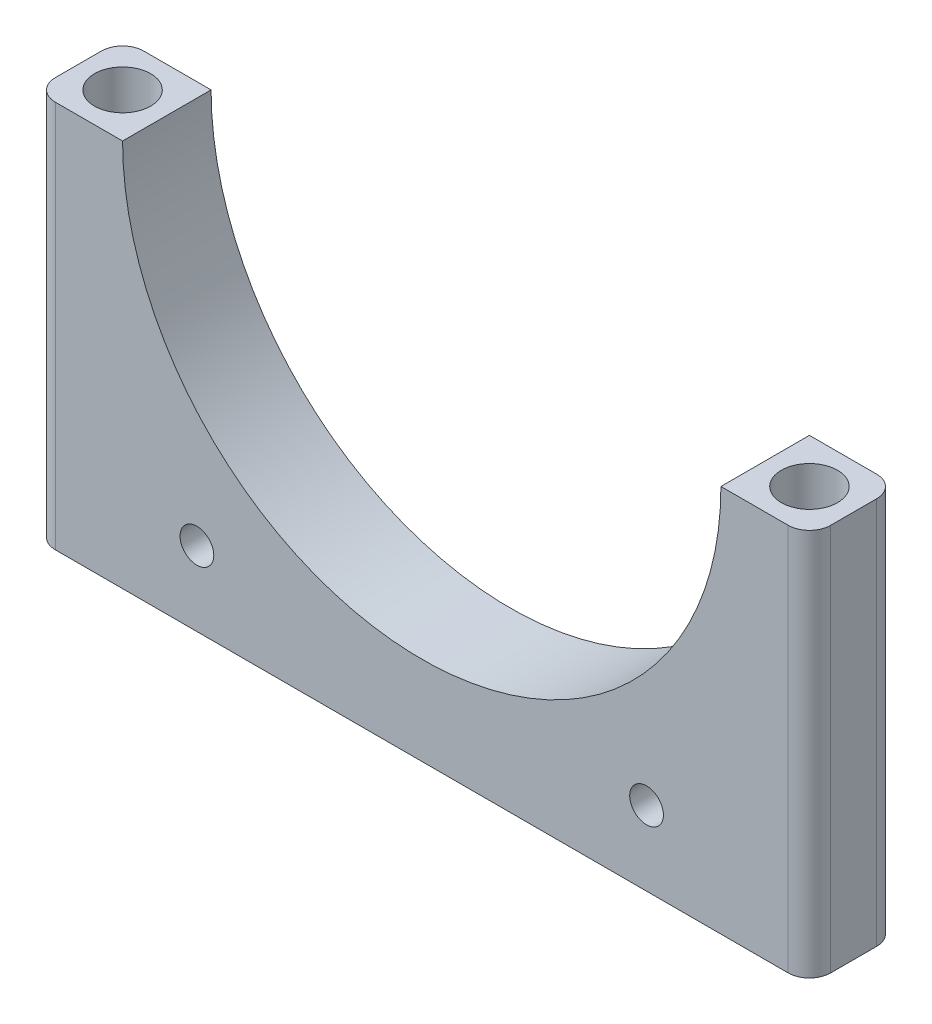
ISO-10303-21;
HEADER;
FILE_DESCRIPTION(('STEP AP214'),'2;1');
FILE_NAME('part.step','',(''),(''),'','','');
FILE_SCHEMA(('AUTOMOTIVE_DESIGN { 1 0 10303 214 1 1 1 1 }'));
ENDSEC;
DATA;
#1=APPLICATION_CONTEXT('core data for automotive mechanical design processes');
#2=APPLICATION_PROTOCOL_DEFINITION('international standard','automotive_design',2000,#1);
#3=PRODUCT_CONTEXT('',#1,'mechanical');
#4=PRODUCT('Part','Part','',(#3));
#5=PRODUCT_RELATED_PRODUCT_CATEGORY('part','',(#4));
#6=PRODUCT_DEFINITION_FORMATION('','',#4);
#7=PRODUCT_DEFINITION_CONTEXT('part definition',#1,'design');
#8=PRODUCT_DEFINITION('design','',#6,#7);
#9=PRODUCT_DEFINITION_SHAPE('','',#8);
#10=(LENGTH_UNIT() NAMED_UNIT(*) SI_UNIT(.MILLI.,.METRE.));
#11=(NAMED_UNIT(*) PLANE_ANGLE_UNIT() SI_UNIT($,.RADIAN.));
#12=(NAMED_UNIT(*) SI_UNIT($,.STERADIAN.) SOLID_ANGLE_UNIT());
#13=UNCERTAINTY_MEASURE_WITH_UNIT(LENGTH_MEASURE(1.E-05),#10,'distance_accuracy_value','');
#14=(GEOMETRIC_REPRESENTATION_CONTEXT(3) GLOBAL_UNCERTAINTY_ASSIGNED_CONTEXT((#13)) GLOBAL_UNIT_ASSIGNED_CONTEXT((#10,
#11,#12)) REPRESENTATION_CONTEXT('',''));
#15=CARTESIAN_POINT('',(0.,0.,0.));
#16=DIRECTION('',(0.,0.,1.));
#17=DIRECTION('',(1.,0.,0.));
#18=AXIS2_PLACEMENT_3D('',#15,#16,#17);
#19=CARTESIAN_POINT('',(0.,0.,25.));
#20=DIRECTION('',(0.,0.,1.));
#21=DIRECTION('',(1.,0.,0.));
#22=AXIS2_PLACEMENT_3D('',#19,#20,#21);
#23=PLANE('',#22);
#24=CARTESIAN_POINT('',(63.5,-3.99999999999999,25.));
#25=DIRECTION('',(0.,0.,1.));
#26=DIRECTION('',(1.,0.,0.));
#27=AXIS2_PLACEMENT_3D('',#24,#25,#26);
#28=CIRCLE('',#27,4.7625);
#29=CARTESIAN_POINT('',(68.2625,-3.99999999999999,25.));
#30=VERTEX_POINT('',#29);
#31=EDGE_CURVE('E235',#30,#30,#28,.F.);
#32=ORIENTED_EDGE('',*,*,#31,.T.);
#33=EDGE_LOOP('',(#32));
#34=FACE_BOUND('',#33,.T.);
#35=DIRECTION('',(-1.,0.,0.));
#36=VECTOR('',#35,1.);
#37=CARTESIAN_POINT('',(0.,-25.,25.));
#38=LINE('',#37,#36);
#39=CARTESIAN_POINT('',(103.5,-25.,25.));
#40=VERTEX_POINT('',#39);
#41=CARTESIAN_POINT('',(-103.5,-25.,25.));
#42=VERTEX_POINT('',#41);
#43=EDGE_CURVE('E140',#40,#42,#38,.T.);
#44=ORIENTED_EDGE('',*,*,#43,.F.);
#45=DIRECTION('',(0.,-1.,0.));
#46=VECTOR('',#45,1.);
#47=CARTESIAN_POINT('',(103.5,0.,25.));
#48=LINE('',#47,#46);
#49=CARTESIAN_POINT('',(103.5,84.5,25.));
#50=VERTEX_POINT('',#49);
#51=EDGE_CURVE('E139',#40,#50,#48,.F.);
#52=ORIENTED_EDGE('',*,*,#51,.T.);
#53=DIRECTION('',(1.,0.,0.));
#54=VECTOR('',#53,1.);
#55=CARTESIAN_POINT('',(0.,84.5,25.));
#56=LINE('',#55,#54);
#57=CARTESIAN_POINT('',(84.5,84.5,25.));
#58=VERTEX_POINT('',#57);
#59=EDGE_CURVE('E121',#58,#50,#56,.T.);
#60=ORIENTED_EDGE('',*,*,#59,.F.);
#61=CARTESIAN_POINT('',(0.,84.5,25.));
#62=DIRECTION('',(0.,0.,1.));
#63=DIRECTION('',(1.,0.,0.));
#64=AXIS2_PLACEMENT_3D('',#61,#62,#63);
#65=CIRCLE('',#64,84.5);
#66=CARTESIAN_POINT('',(-84.5,84.5,25.));
#67=VERTEX_POINT('',#66);
#68=EDGE_CURVE('E137',#67,#58,#65,.T.);
#69=ORIENTED_EDGE('',*,*,#68,.F.);
#70=CARTESIAN_POINT('',(-103.5,84.5,25.));
#71=VERTEX_POINT('',#70);
#72=EDGE_CURVE('E142',#71,#67,#56,.T.);
#73=ORIENTED_EDGE('',*,*,#72,.F.);
#74=DIRECTION('',(0.,-1.,0.));
#75=VECTOR('',#74,1.);
#76=CARTESIAN_POINT('',(-103.5,-25.,25.));
#77=LINE('',#76,#75);
#78=EDGE_CURVE('E189',#71,#42,#77,.T.);
#79=ORIENTED_EDGE('',*,*,#78,.T.);
#80=EDGE_LOOP('',(#44,#52,#60,#69,#73,#79));
#81=FACE_BOUND('',#80,.T.);
#82=CARTESIAN_POINT('',(-63.5,-4.00000000000001,25.));
#83=DIRECTION('',(0.,0.,1.));
#84=DIRECTION('',(1.,0.,0.));
#85=AXIS2_PLACEMENT_3D('',#82,#83,#84);
#86=CIRCLE('',#85,4.7625);
#87=CARTESIAN_POINT('',(-58.7375,-4.00000000000001,25.));
#88=VERTEX_POINT('',#87);
#89=EDGE_CURVE('E173',#88,#88,#86,.T.);
#90=ORIENTED_EDGE('',*,*,#89,.F.);
#91=EDGE_LOOP('',(#90));
#92=FACE_BOUND('',#91,.T.);
#93=ADVANCED_FACE('F41',(#34,#81,#92),#23,.T.);
#94=CARTESIAN_POINT('',(0.,0.,0.));
#95=DIRECTION('',(0.,0.,1.));
#96=DIRECTION('',(1.,0.,0.));
#97=AXIS2_PLACEMENT_3D('',#94,#95,#96);
#98=PLANE('',#97);
#99=DIRECTION('',(1.,0.,0.));
#100=VECTOR('',#99,1.);
#101=CARTESIAN_POINT('',(0.,84.5,0.));
#102=LINE('',#101,#100);
#103=CARTESIAN_POINT('',(84.5,84.5,0.));
#104=VERTEX_POINT('',#103);
#105=CARTESIAN_POINT('',(103.5,84.5,0.));
#106=VERTEX_POINT('',#105);
#107=EDGE_CURVE('E124',#104,#106,#102,.T.);
#108=ORIENTED_EDGE('',*,*,#107,.T.);
#109=DIRECTION('',(0.,-1.,0.));
#110=VECTOR('',#109,1.);
#111=CARTESIAN_POINT('',(103.5,-25.,0.));
#112=LINE('',#111,#110);
#113=CARTESIAN_POINT('',(103.5,-25.,0.));
#114=VERTEX_POINT('',#113);
#115=EDGE_CURVE('E199',#106,#114,#112,.T.);
#116=ORIENTED_EDGE('',*,*,#115,.T.);
#117=DIRECTION('',(-1.,0.,0.));
#118=VECTOR('',#117,1.);
#119=CARTESIAN_POINT('',(0.,-25.,0.));
#120=LINE('',#119,#118);
#121=CARTESIAN_POINT('',(-103.5,-25.,0.));
#122=VERTEX_POINT('',#121);
#123=EDGE_CURVE('E150',#114,#122,#120,.T.);
#124=ORIENTED_EDGE('',*,*,#123,.T.);
#125=DIRECTION('',(0.,-1.,0.));
#126=VECTOR('',#125,1.);
#127=CARTESIAN_POINT('',(-103.5,0.,0.));
#128=LINE('',#127,#126);
#129=CARTESIAN_POINT('',(-103.5,84.5,0.));
#130=VERTEX_POINT('',#129);
#131=EDGE_CURVE('E197',#122,#130,#128,.F.);
#132=ORIENTED_EDGE('',*,*,#131,.T.);
#133=CARTESIAN_POINT('',(-84.5,84.5,0.));
#134=VERTEX_POINT('',#133);
#135=EDGE_CURVE('E156',#130,#134,#102,.T.);
#136=ORIENTED_EDGE('',*,*,#135,.T.);
#137=CARTESIAN_POINT('',(0.,84.5,0.));
#138=DIRECTION('',(0.,0.,1.));
#139=DIRECTION('',(1.,0.,0.));
#140=AXIS2_PLACEMENT_3D('',#137,#138,#139);
#141=CIRCLE('',#140,84.5);
#142=EDGE_CURVE('E155',#134,#104,#141,.T.);
#143=ORIENTED_EDGE('',*,*,#142,.T.);
#144=EDGE_LOOP('',(#108,#116,#124,#132,#136,#143));
#145=FACE_BOUND('',#144,.T.);
#146=CARTESIAN_POINT('',(63.5,-3.99999999999999,0.));
#147=DIRECTION('',(0.,0.,1.));
#148=DIRECTION('',(1.,0.,0.));
#149=AXIS2_PLACEMENT_3D('',#146,#147,#148);
#150=CIRCLE('',#149,4.7625);
#151=CARTESIAN_POINT('',(68.2625,-3.99999999999999,0.));
#152=VERTEX_POINT('',#151);
#153=EDGE_CURVE('E169',#152,#152,#150,.F.);
#154=ORIENTED_EDGE('',*,*,#153,.F.);
#155=EDGE_LOOP('',(#154));
#156=FACE_BOUND('',#155,.T.);
#157=CARTESIAN_POINT('',(-63.5,-4.00000000000001,0.));
#158=DIRECTION('',(0.,0.,1.));
#159=DIRECTION('',(1.,0.,0.));
#160=AXIS2_PLACEMENT_3D('',#157,#158,#159);
#161=CIRCLE('',#160,4.7625);
#162=CARTESIAN_POINT('',(-58.7375,-4.00000000000001,0.));
#163=VERTEX_POINT('',#162);
#164=EDGE_CURVE('E172',#163,#163,#161,.T.);
#165=ORIENTED_EDGE('',*,*,#164,.T.);
#166=EDGE_LOOP('',(#165));
#167=FACE_BOUND('',#166,.T.);
#168=ADVANCED_FACE('F220',(#145,#156,#167),#98,.F.);
#169=CARTESIAN_POINT('',(0.,-25.,25.));
#170=DIRECTION('',(0.,-1.,0.));
#171=DIRECTION('',(0.,0.,-1.));
#172=AXIS2_PLACEMENT_3D('',#169,#170,#171);
#173=PLANE('',#172);
#174=CARTESIAN_POINT('',(97.,-25.0000000000004,12.5));
#175=DIRECTION('',(0.,-1.,0.));
#176=DIRECTION('',(0.,0.,-1.));
#177=AXIS2_PLACEMENT_3D('',#174,#175,#176);
#178=CIRCLE('',#177,7.94);
#179=CARTESIAN_POINT('',(97.,-25.0000000000004,4.55999999999997));
#180=VERTEX_POINT('',#179);
#181=EDGE_CURVE('E153',#180,#180,#178,.F.);
#182=ORIENTED_EDGE('',*,*,#181,.T.);
#183=EDGE_LOOP('',(#182));
#184=FACE_BOUND('',#183,.T.);
#185=DIRECTION('',(0.,0.,-1.));
#186=VECTOR('',#185,1.);
#187=CARTESIAN_POINT('',(109.5,-25.,25.));
#188=LINE('',#187,#186);
#189=CARTESIAN_POINT('',(109.5,-25.,19.));
#190=VERTEX_POINT('',#189);
#191=CARTESIAN_POINT('',(109.5,-25.,6.));
#192=VERTEX_POINT('',#191);
#193=EDGE_CURVE('E165',#190,#192,#188,.T.);
#194=ORIENTED_EDGE('',*,*,#193,.F.);
#195=CARTESIAN_POINT('',(103.5,-25.,19.));
#196=DIRECTION('',(0.,-1.,0.));
#197=DIRECTION('',(0.,0.,-1.));
#198=AXIS2_PLACEMENT_3D('',#195,#196,#197);
#199=CIRCLE('',#198,6.);
#200=EDGE_CURVE('E187',#190,#40,#199,.T.);
#201=ORIENTED_EDGE('',*,*,#200,.T.);
#202=ORIENTED_EDGE('',*,*,#43,.T.);
#203=CARTESIAN_POINT('',(-103.5,-25.,19.));
#204=DIRECTION('',(0.,-1.,0.));
#205=DIRECTION('',(0.,0.,-1.));
#206=AXIS2_PLACEMENT_3D('',#203,#204,#205);
#207=CIRCLE('',#206,6.);
#208=CARTESIAN_POINT('',(-109.5,-25.,19.));
#209=VERTEX_POINT('',#208);
#210=EDGE_CURVE('E183',#42,#209,#207,.T.);
#211=ORIENTED_EDGE('',*,*,#210,.T.);
#212=DIRECTION('',(0.,0.,-1.));
#213=VECTOR('',#212,1.);
#214=CARTESIAN_POINT('',(-109.5,-25.,25.));
#215=LINE('',#214,#213);
#216=CARTESIAN_POINT('',(-109.5,-25.,6.));
#217=VERTEX_POINT('',#216);
#218=EDGE_CURVE('E147',#209,#217,#215,.T.);
#219=ORIENTED_EDGE('',*,*,#218,.T.);
#220=CARTESIAN_POINT('',(-103.5,-25.,6.));
#221=DIRECTION('',(0.,-1.,0.));
#222=DIRECTION('',(0.,0.,-1.));
#223=AXIS2_PLACEMENT_3D('',#220,#221,#222);
#224=CIRCLE('',#223,6.);
#225=EDGE_CURVE('E181',#217,#122,#224,.T.);
#226=ORIENTED_EDGE('',*,*,#225,.T.);
#227=ORIENTED_EDGE('',*,*,#123,.F.);
#228=CARTESIAN_POINT('',(103.5,-25.,6.));
#229=DIRECTION('',(0.,-1.,0.));
#230=DIRECTION('',(0.,0.,-1.));
#231=AXIS2_PLACEMENT_3D('',#228,#229,#230);
#232=CIRCLE('',#231,6.);
#233=EDGE_CURVE('E185',#114,#192,#232,.T.);
#234=ORIENTED_EDGE('',*,*,#233,.T.);
#235=EDGE_LOOP('',(#194,#201,#202,#211,#219,#226,#227,#234));
#236=FACE_BOUND('',#235,.T.);
#237=CARTESIAN_POINT('',(-97.,-25.0000000000004,12.5));
#238=DIRECTION('',(0.,-1.,0.));
#239=DIRECTION('',(0.,0.,-1.));
#240=AXIS2_PLACEMENT_3D('',#237,#238,#239);
#241=CIRCLE('',#240,7.94);
#242=CARTESIAN_POINT('',(-97.,-25.0000000000004,4.56));
#243=VERTEX_POINT('',#242);
#244=EDGE_CURVE('E227',#243,#243,#241,.T.);
#245=ORIENTED_EDGE('',*,*,#244,.F.);
#246=EDGE_LOOP('',(#245));
#247=FACE_BOUND('',#246,.T.);
#248=ADVANCED_FACE('F210',(#184,#236,#247),#173,.T.);
#249=CARTESIAN_POINT('',(109.5,0.,25.));
#250=DIRECTION('',(1.,0.,0.));
#251=DIRECTION('',(0.,1.,0.));
#252=AXIS2_PLACEMENT_3D('',#249,#250,#251);
#253=PLANE('',#252);
#254=DIRECTION('',(0.,0.,-1.));
#255=VECTOR('',#254,1.);
#256=CARTESIAN_POINT('',(109.5,84.5,25.));
#257=LINE('',#256,#255);
#258=CARTESIAN_POINT('',(109.5,84.5,19.));
#259=VERTEX_POINT('',#258);
#260=CARTESIAN_POINT('',(109.5,84.5,6.));
#261=VERTEX_POINT('',#260);
#262=EDGE_CURVE('E129',#259,#261,#257,.T.);
#263=ORIENTED_EDGE('',*,*,#262,.F.);
#264=DIRECTION('',(0.,-1.,0.));
#265=VECTOR('',#264,1.);
#266=CARTESIAN_POINT('',(109.5,0.,19.));
#267=LINE('',#266,#265);
#268=EDGE_CURVE('E178',#259,#190,#267,.T.);
#269=ORIENTED_EDGE('',*,*,#268,.T.);
#270=ORIENTED_EDGE('',*,*,#193,.T.);
#271=DIRECTION('',(0.,-1.,0.));
#272=VECTOR('',#271,1.);
#273=CARTESIAN_POINT('',(109.5,84.5,6.));
#274=LINE('',#273,#272);
#275=EDGE_CURVE('E168',#192,#261,#274,.F.);
#276=ORIENTED_EDGE('',*,*,#275,.T.);
#277=EDGE_LOOP('',(#263,#269,#270,#276));
#278=FACE_BOUND('',#277,.T.);
#279=ADVANCED_FACE('F263',(#278),#253,.T.);
#280=CARTESIAN_POINT('',(0.,84.5,25.));
#281=DIRECTION('',(0.,1.,0.));
#282=DIRECTION('',(0.,0.,1.));
#283=AXIS2_PLACEMENT_3D('',#280,#281,#282);
#284=PLANE('',#283);
#285=CARTESIAN_POINT('',(97.,84.5,12.5));
#286=DIRECTION('',(0.,-1.,0.));
#287=DIRECTION('',(0.,0.,-1.));
#288=AXIS2_PLACEMENT_3D('',#285,#286,#287);
#289=CIRCLE('',#288,7.94);
#290=CARTESIAN_POINT('',(97.,84.5,4.55999999999997));
#291=VERTEX_POINT('',#290);
#292=EDGE_CURVE('E176',#291,#291,#289,.T.);
#293=ORIENTED_EDGE('',*,*,#292,.T.);
#294=EDGE_LOOP('',(#293));
#295=FACE_BOUND('',#294,.T.);
#296=ORIENTED_EDGE('',*,*,#59,.T.);
#297=CARTESIAN_POINT('',(103.5,84.5,19.));
#298=DIRECTION('',(0.,1.,0.));
#299=DIRECTION('',(0.,0.,1.));
#300=AXIS2_PLACEMENT_3D('',#297,#298,#299);
#301=CIRCLE('',#300,6.);
#302=EDGE_CURVE('E195',#50,#259,#301,.T.);
#303=ORIENTED_EDGE('',*,*,#302,.T.);
#304=ORIENTED_EDGE('',*,*,#262,.T.);
#305=CARTESIAN_POINT('',(103.5,84.5,6.));
#306=DIRECTION('',(0.,1.,0.));
#307=DIRECTION('',(0.,0.,1.));
#308=AXIS2_PLACEMENT_3D('',#305,#306,#307);
#309=CIRCLE('',#308,6.);
#310=EDGE_CURVE('E193',#261,#106,#309,.T.);
#311=ORIENTED_EDGE('',*,*,#310,.T.);
#312=ORIENTED_EDGE('',*,*,#107,.F.);
#313=DIRECTION('',(0.,0.,-1.));
#314=VECTOR('',#313,1.);
#315=CARTESIAN_POINT('',(84.5,84.5,25.));
#316=LINE('',#315,#314);
#317=EDGE_CURVE('E118',#58,#104,#316,.T.);
#318=ORIENTED_EDGE('',*,*,#317,.F.);
#319=EDGE_LOOP('',(#296,#303,#304,#311,#312,#318));
#320=FACE_BOUND('',#319,.T.);
#321=ADVANCED_FACE('F120',(#295,#320),#284,.T.);
#322=CARTESIAN_POINT('',(0.,84.5,25.));
#323=DIRECTION('',(0.,0.,-1.));
#324=DIRECTION('',(-1.,0.,0.));
#325=AXIS2_PLACEMENT_3D('',#322,#323,#324);
#326=CYLINDRICAL_SURFACE('',#325,84.5);
#327=ORIENTED_EDGE('',*,*,#142,.F.);
#328=DIRECTION('',(0.,0.,-1.));
#329=VECTOR('',#328,1.);
#330=CARTESIAN_POINT('',(-84.5,84.5,25.));
#331=LINE('',#330,#329);
#332=EDGE_CURVE('E130',#67,#134,#331,.T.);
#333=ORIENTED_EDGE('',*,*,#332,.F.);
#334=ORIENTED_EDGE('',*,*,#68,.T.);
#335=ORIENTED_EDGE('',*,*,#317,.T.);
#336=EDGE_LOOP('',(#327,#333,#334,#335));
#337=FACE_BOUND('',#336,.T.);
#338=ADVANCED_FACE('F144',(#337),#326,.F.);
#339=CARTESIAN_POINT('',(-97.,84.5,12.5));
#340=DIRECTION('',(0.,1.,0.));
#341=DIRECTION('',(0.,0.,1.));
#342=AXIS2_PLACEMENT_3D('',#339,#340,#341);
#343=CIRCLE('',#342,7.94);
#344=CARTESIAN_POINT('',(-97.,84.5,20.44));
#345=VERTEX_POINT('',#344);
#346=EDGE_CURVE('E230',#345,#345,#343,.T.);
#347=ORIENTED_EDGE('',*,*,#346,.F.);
#348=EDGE_LOOP('',(#347));
#349=FACE_BOUND('',#348,.T.);
#350=DIRECTION('',(0.,0.,-1.));
#351=VECTOR('',#350,1.);
#352=CARTESIAN_POINT('',(-109.5,84.5,25.));
#353=LINE('',#352,#351);
#354=CARTESIAN_POINT('',(-109.5,84.5,19.));
#355=VERTEX_POINT('',#354);
#356=CARTESIAN_POINT('',(-109.5,84.5,6.));
#357=VERTEX_POINT('',#356);
#358=EDGE_CURVE('E160',#355,#357,#353,.T.);
#359=ORIENTED_EDGE('',*,*,#358,.F.);
#360=CARTESIAN_POINT('',(-103.5,84.5,19.));
#361=DIRECTION('',(0.,1.,0.));
#362=DIRECTION('',(0.,0.,1.));
#363=AXIS2_PLACEMENT_3D('',#360,#361,#362);
#364=CIRCLE('',#363,6.);
#365=EDGE_CURVE('E11',#355,#71,#364,.T.);
#366=ORIENTED_EDGE('',*,*,#365,.T.);
#367=ORIENTED_EDGE('',*,*,#72,.T.);
#368=ORIENTED_EDGE('',*,*,#332,.T.);
#369=ORIENTED_EDGE('',*,*,#135,.F.);
#370=CARTESIAN_POINT('',(-103.5,84.5,6.));
#371=DIRECTION('',(0.,1.,0.));
#372=DIRECTION('',(0.,0.,1.));
#373=AXIS2_PLACEMENT_3D('',#370,#371,#372);
#374=CIRCLE('',#373,6.);
#375=EDGE_CURVE('E49',#130,#357,#374,.T.);
#376=ORIENTED_EDGE('',*,*,#375,.T.);
#377=EDGE_LOOP('',(#359,#366,#367,#368,#369,#376));
#378=FACE_BOUND('',#377,.T.);
#379=ADVANCED_FACE('F218',(#349,#378),#284,.T.);
#380=CARTESIAN_POINT('',(-109.5,0.,25.));
#381=DIRECTION('',(1.,0.,0.));
#382=DIRECTION('',(0.,1.,0.));
#383=AXIS2_PLACEMENT_3D('',#380,#381,#382);
#384=PLANE('',#383);
#385=ORIENTED_EDGE('',*,*,#218,.F.);
#386=DIRECTION('',(0.,-1.,0.));
#387=VECTOR('',#386,1.);
#388=CARTESIAN_POINT('',(-109.5,84.5,19.));
#389=LINE('',#388,#387);
#390=EDGE_CURVE('E62',#209,#355,#389,.F.);
#391=ORIENTED_EDGE('',*,*,#390,.T.);
#392=ORIENTED_EDGE('',*,*,#358,.T.);
#393=DIRECTION('',(0.,-1.,0.));
#394=VECTOR('',#393,1.);
#395=CARTESIAN_POINT('',(-109.5,0.,6.));
#396=LINE('',#395,#394);
#397=EDGE_CURVE('E202',#357,#217,#396,.T.);
#398=ORIENTED_EDGE('',*,*,#397,.T.);
#399=EDGE_LOOP('',(#385,#391,#392,#398));
#400=FACE_BOUND('',#399,.T.);
#401=ADVANCED_FACE('F206',(#400),#384,.F.);
#402=CARTESIAN_POINT('',(-97.,-4915.5,12.5));
#403=DIRECTION('',(0.,1.,0.));
#404=DIRECTION('',(0.,0.,1.));
#405=AXIS2_PLACEMENT_3D('',#402,#403,#404);
#406=CYLINDRICAL_SURFACE('',#405,7.94);
#407=ORIENTED_EDGE('',*,*,#244,.T.);
#408=EDGE_LOOP('',(#407));
#409=FACE_BOUND('',#408,.T.);
#410=ORIENTED_EDGE('',*,*,#346,.T.);
#411=EDGE_LOOP('',(#410));
#412=FACE_BOUND('',#411,.T.);
#413=ADVANCED_FACE('F257',(#409,#412),#406,.F.);
#414=CARTESIAN_POINT('',(97.,-4915.5,12.5));
#415=DIRECTION('',(0.,1.,0.));
#416=DIRECTION('',(0.,0.,1.));
#417=AXIS2_PLACEMENT_3D('',#414,#415,#416);
#418=CYLINDRICAL_SURFACE('',#417,7.94);
#419=ORIENTED_EDGE('',*,*,#181,.F.);
#420=EDGE_LOOP('',(#419));
#421=FACE_BOUND('',#420,.T.);
#422=ORIENTED_EDGE('',*,*,#292,.F.);
#423=EDGE_LOOP('',(#422));
#424=FACE_BOUND('',#423,.T.);
#425=ADVANCED_FACE('F252',(#421,#424),#418,.F.);
#426=CARTESIAN_POINT('',(63.5,-3.99999999999999,-4975.));
#427=DIRECTION('',(0.,0.,1.));
#428=DIRECTION('',(1.,0.,0.));
#429=AXIS2_PLACEMENT_3D('',#426,#427,#428);
#430=CYLINDRICAL_SURFACE('',#429,4.7625);
#431=ORIENTED_EDGE('',*,*,#31,.F.);
#432=EDGE_LOOP('',(#431));
#433=FACE_BOUND('',#432,.T.);
#434=ORIENTED_EDGE('',*,*,#153,.T.);
#435=EDGE_LOOP('',(#434));
#436=FACE_BOUND('',#435,.T.);
#437=ADVANCED_FACE('F308',(#433,#436),#430,.F.);
#438=CARTESIAN_POINT('',(-63.5,-4.00000000000001,-4975.));
#439=DIRECTION('',(0.,0.,1.));
#440=DIRECTION('',(1.,0.,0.));
#441=AXIS2_PLACEMENT_3D('',#438,#439,#440);
#442=CYLINDRICAL_SURFACE('',#441,4.7625);
#443=ORIENTED_EDGE('',*,*,#89,.T.);
#444=EDGE_LOOP('',(#443));
#445=FACE_BOUND('',#444,.T.);
#446=ORIENTED_EDGE('',*,*,#164,.F.);
#447=EDGE_LOOP('',(#446));
#448=FACE_BOUND('',#447,.T.);
#449=ADVANCED_FACE('F241',(#445,#448),#442,.F.);
#450=CARTESIAN_POINT('',(103.5,0.,19.));
#451=DIRECTION('',(0.,-1.,0.));
#452=DIRECTION('',(1.,0.,0.));
#453=AXIS2_PLACEMENT_3D('',#450,#451,#452);
#454=CYLINDRICAL_SURFACE('',#453,6.);
#455=ORIENTED_EDGE('',*,*,#302,.F.);
#456=ORIENTED_EDGE('',*,*,#51,.F.);
#457=ORIENTED_EDGE('',*,*,#200,.F.);
#458=ORIENTED_EDGE('',*,*,#268,.F.);
#459=EDGE_LOOP('',(#455,#456,#457,#458));
#460=FACE_BOUND('',#459,.T.);
#461=ADVANCED_FACE('F270',(#460),#454,.T.);
#462=CARTESIAN_POINT('',(103.5,0.,6.));
#463=DIRECTION('',(0.,1.,0.));
#464=DIRECTION('',(-1.,0.,0.));
#465=AXIS2_PLACEMENT_3D('',#462,#463,#464);
#466=CYLINDRICAL_SURFACE('',#465,6.);
#467=ORIENTED_EDGE('',*,*,#310,.F.);
#468=ORIENTED_EDGE('',*,*,#275,.F.);
#469=ORIENTED_EDGE('',*,*,#233,.F.);
#470=ORIENTED_EDGE('',*,*,#115,.F.);
#471=EDGE_LOOP('',(#467,#468,#469,#470));
#472=FACE_BOUND('',#471,.T.);
#473=ADVANCED_FACE('F273',(#472),#466,.T.);
#474=CARTESIAN_POINT('',(-103.5,0.,19.));
#475=DIRECTION('',(0.,1.,0.));
#476=DIRECTION('',(-1.,0.,0.));
#477=AXIS2_PLACEMENT_3D('',#474,#475,#476);
#478=CYLINDRICAL_SURFACE('',#477,6.);
#479=ORIENTED_EDGE('',*,*,#365,.F.);
#480=ORIENTED_EDGE('',*,*,#390,.F.);
#481=ORIENTED_EDGE('',*,*,#210,.F.);
#482=ORIENTED_EDGE('',*,*,#78,.F.);
#483=EDGE_LOOP('',(#479,#480,#481,#482));
#484=FACE_BOUND('',#483,.T.);
#485=ADVANCED_FACE('F217',(#484),#478,.T.);
#486=CARTESIAN_POINT('',(-103.5,0.,6.));
#487=DIRECTION('',(0.,-1.,0.));
#488=DIRECTION('',(1.,0.,0.));
#489=AXIS2_PLACEMENT_3D('',#486,#487,#488);
#490=CYLINDRICAL_SURFACE('',#489,6.);
#491=ORIENTED_EDGE('',*,*,#375,.F.);
#492=ORIENTED_EDGE('',*,*,#131,.F.);
#493=ORIENTED_EDGE('',*,*,#225,.F.);
#494=ORIENTED_EDGE('',*,*,#397,.F.);
#495=EDGE_LOOP('',(#491,#492,#493,#494));
#496=FACE_BOUND('',#495,.T.);
#497=ADVANCED_FACE('F43',(#496),#490,.T.);
#498=CLOSED_SHELL('',(#93,#168,#248,#279,#321,#338,#379,#401,#413,#425,#437,#449,#461,#473,#485,#497));
#499=MANIFOLD_SOLID_BREP('B2',#498);
#500=ADVANCED_BREP_SHAPE_REPRESENTATION('',(#18,#499),#14);
#501=SHAPE_DEFINITION_REPRESENTATION(#9,#500);
ENDSEC;
END-ISO-10303-21;
